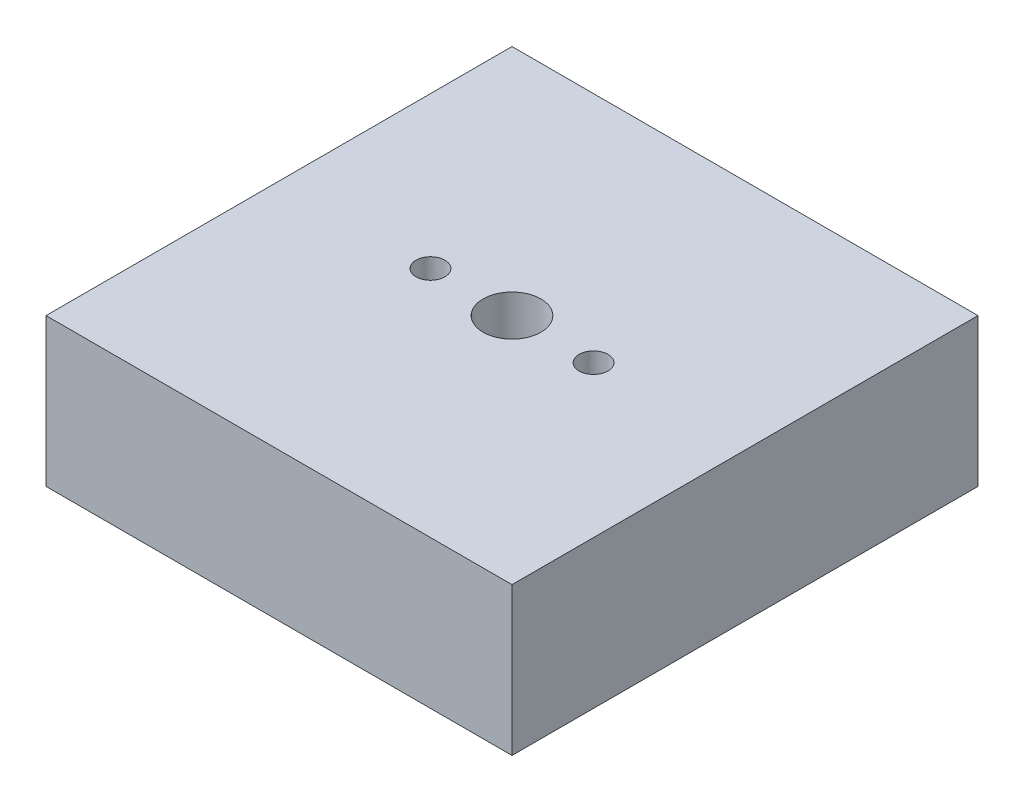
ISO-10303-21;
HEADER;
FILE_DESCRIPTION(('STEP AP214'),'2;1');
FILE_NAME('part.step','',(''),(''),'','','');
FILE_SCHEMA(('AUTOMOTIVE_DESIGN { 1 0 10303 214 1 1 1 1 }'));
ENDSEC;
DATA;
#1=APPLICATION_CONTEXT('core data for automotive mechanical design processes');
#2=APPLICATION_PROTOCOL_DEFINITION('international standard','automotive_design',2000,#1);
#3=PRODUCT_CONTEXT('',#1,'mechanical');
#4=PRODUCT('Part','Part','',(#3));
#5=PRODUCT_RELATED_PRODUCT_CATEGORY('part','',(#4));
#6=PRODUCT_DEFINITION_FORMATION('','',#4);
#7=PRODUCT_DEFINITION_CONTEXT('part definition',#1,'design');
#8=PRODUCT_DEFINITION('design','',#6,#7);
#9=PRODUCT_DEFINITION_SHAPE('','',#8);
#10=(LENGTH_UNIT() NAMED_UNIT(*) SI_UNIT(.MILLI.,.METRE.));
#11=(NAMED_UNIT(*) PLANE_ANGLE_UNIT() SI_UNIT($,.RADIAN.));
#12=(NAMED_UNIT(*) SI_UNIT($,.STERADIAN.) SOLID_ANGLE_UNIT());
#13=UNCERTAINTY_MEASURE_WITH_UNIT(LENGTH_MEASURE(1.E-05),#10,'distance_accuracy_value','');
#14=(GEOMETRIC_REPRESENTATION_CONTEXT(3) GLOBAL_UNCERTAINTY_ASSIGNED_CONTEXT((#13)) GLOBAL_UNIT_ASSIGNED_CONTEXT((#10,
#11,#12)) REPRESENTATION_CONTEXT('',''));
#15=CARTESIAN_POINT('',(0.,0.,0.));
#16=DIRECTION('',(0.,0.,1.));
#17=DIRECTION('',(1.,0.,0.));
#18=AXIS2_PLACEMENT_3D('',#15,#16,#17);
#19=CARTESIAN_POINT('',(0.,3.175,0.));
#20=DIRECTION('',(0.,-1.,0.));
#21=DIRECTION('',(0.,0.,-1.));
#22=AXIS2_PLACEMENT_3D('',#19,#20,#21);
#23=PLANE('',#22);
#24=CARTESIAN_POINT('',(0.,3.175,0.));
#25=DIRECTION('',(0.,1.,0.));
#26=DIRECTION('',(0.,0.,1.));
#27=AXIS2_PLACEMENT_3D('',#24,#25,#26);
#28=CIRCLE('',#27,0.62);
#29=CARTESIAN_POINT('',(0.,3.175,0.62));
#30=VERTEX_POINT('',#29);
#31=EDGE_CURVE('E115',#30,#30,#28,.T.);
#32=ORIENTED_EDGE('',*,*,#31,.F.);
#33=EDGE_LOOP('',(#32));
#34=FACE_BOUND('',#33,.T.);
#35=DIRECTION('',(0.,0.,1.));
#36=VECTOR('',#35,1.);
#37=CARTESIAN_POINT('',(-5.,3.175,5.));
#38=LINE('',#37,#36);
#39=CARTESIAN_POINT('',(-5.,3.175,-5.));
#40=VERTEX_POINT('',#39);
#41=CARTESIAN_POINT('',(-5.,3.175,5.));
#42=VERTEX_POINT('',#41);
#43=EDGE_CURVE('E85',#40,#42,#38,.T.);
#44=ORIENTED_EDGE('',*,*,#43,.T.);
#45=DIRECTION('',(1.,0.,0.));
#46=VECTOR('',#45,1.);
#47=CARTESIAN_POINT('',(-5.,3.175,5.));
#48=LINE('',#47,#46);
#49=CARTESIAN_POINT('',(5.,3.175,5.));
#50=VERTEX_POINT('',#49);
#51=EDGE_CURVE('E80',#42,#50,#48,.T.);
#52=ORIENTED_EDGE('',*,*,#51,.T.);
#53=DIRECTION('',(0.,0.,-1.));
#54=VECTOR('',#53,1.);
#55=CARTESIAN_POINT('',(5.,3.175,5.));
#56=LINE('',#55,#54);
#57=CARTESIAN_POINT('',(5.,3.175,-5.));
#58=VERTEX_POINT('',#57);
#59=EDGE_CURVE('E83',#50,#58,#56,.T.);
#60=ORIENTED_EDGE('',*,*,#59,.T.);
#61=DIRECTION('',(-1.,0.,0.));
#62=VECTOR('',#61,1.);
#63=CARTESIAN_POINT('',(-5.,3.175,-5.));
#64=LINE('',#63,#62);
#65=EDGE_CURVE('E50',#58,#40,#64,.T.);
#66=ORIENTED_EDGE('',*,*,#65,.T.);
#67=EDGE_LOOP('',(#44,#52,#60,#66));
#68=FACE_BOUND('',#67,.T.);
#69=CARTESIAN_POINT('',(-1.75,3.175,0.));
#70=DIRECTION('',(0.,1.,0.));
#71=DIRECTION('',(0.,0.,1.));
#72=AXIS2_PLACEMENT_3D('',#69,#70,#71);
#73=CIRCLE('',#72,0.31);
#74=CARTESIAN_POINT('',(-1.75,3.175,0.31));
#75=VERTEX_POINT('',#74);
#76=EDGE_CURVE('E100',#75,#75,#73,.T.);
#77=ORIENTED_EDGE('',*,*,#76,.F.);
#78=EDGE_LOOP('',(#77));
#79=FACE_BOUND('',#78,.T.);
#80=CARTESIAN_POINT('',(1.75,3.175,0.));
#81=DIRECTION('',(0.,1.,0.));
#82=DIRECTION('',(0.,0.,1.));
#83=AXIS2_PLACEMENT_3D('',#80,#81,#82);
#84=CIRCLE('',#83,0.31);
#85=CARTESIAN_POINT('',(1.75,3.175,0.31));
#86=VERTEX_POINT('',#85);
#87=EDGE_CURVE('E121',#86,#86,#84,.T.);
#88=ORIENTED_EDGE('',*,*,#87,.F.);
#89=EDGE_LOOP('',(#88));
#90=FACE_BOUND('',#89,.T.);
#91=ADVANCED_FACE('F33',(#34,#68,#79,#90),#23,.F.);
#92=CARTESIAN_POINT('',(0.,0.,0.));
#93=DIRECTION('',(0.,-1.,0.));
#94=DIRECTION('',(0.,0.,-1.));
#95=AXIS2_PLACEMENT_3D('',#92,#93,#94);
#96=PLANE('',#95);
#97=CARTESIAN_POINT('',(0.,0.,0.));
#98=DIRECTION('',(0.,1.,0.));
#99=DIRECTION('',(0.,0.,1.));
#100=AXIS2_PLACEMENT_3D('',#97,#98,#99);
#101=CIRCLE('',#100,0.62);
#102=CARTESIAN_POINT('',(0.,0.,0.62));
#103=VERTEX_POINT('',#102);
#104=EDGE_CURVE('E118',#103,#103,#101,.T.);
#105=ORIENTED_EDGE('',*,*,#104,.T.);
#106=EDGE_LOOP('',(#105));
#107=FACE_BOUND('',#106,.T.);
#108=DIRECTION('',(0.,0.,1.));
#109=VECTOR('',#108,1.);
#110=CARTESIAN_POINT('',(-5.,0.,5.));
#111=LINE('',#110,#109);
#112=CARTESIAN_POINT('',(-5.,0.,-5.));
#113=VERTEX_POINT('',#112);
#114=CARTESIAN_POINT('',(-5.,0.,5.));
#115=VERTEX_POINT('',#114);
#116=EDGE_CURVE('E97',#113,#115,#111,.T.);
#117=ORIENTED_EDGE('',*,*,#116,.F.);
#118=DIRECTION('',(-1.,0.,0.));
#119=VECTOR('',#118,1.);
#120=CARTESIAN_POINT('',(-5.,0.,-5.));
#121=LINE('',#120,#119);
#122=CARTESIAN_POINT('',(5.,0.,-5.));
#123=VERTEX_POINT('',#122);
#124=EDGE_CURVE('E73',#123,#113,#121,.T.);
#125=ORIENTED_EDGE('',*,*,#124,.F.);
#126=DIRECTION('',(0.,0.,-1.));
#127=VECTOR('',#126,1.);
#128=CARTESIAN_POINT('',(5.,0.,5.));
#129=LINE('',#128,#127);
#130=CARTESIAN_POINT('',(5.,0.,5.));
#131=VERTEX_POINT('',#130);
#132=EDGE_CURVE('E67',#131,#123,#129,.T.);
#133=ORIENTED_EDGE('',*,*,#132,.F.);
#134=DIRECTION('',(1.,0.,0.));
#135=VECTOR('',#134,1.);
#136=CARTESIAN_POINT('',(-5.,0.,5.));
#137=LINE('',#136,#135);
#138=EDGE_CURVE('E89',#115,#131,#137,.T.);
#139=ORIENTED_EDGE('',*,*,#138,.F.);
#140=EDGE_LOOP('',(#117,#125,#133,#139));
#141=FACE_BOUND('',#140,.T.);
#142=CARTESIAN_POINT('',(-1.75,0.,0.));
#143=DIRECTION('',(0.,1.,0.));
#144=DIRECTION('',(0.,0.,1.));
#145=AXIS2_PLACEMENT_3D('',#142,#143,#144);
#146=CIRCLE('',#145,0.31);
#147=CARTESIAN_POINT('',(-1.75,0.,0.31));
#148=VERTEX_POINT('',#147);
#149=EDGE_CURVE('E112',#148,#148,#146,.T.);
#150=ORIENTED_EDGE('',*,*,#149,.T.);
#151=EDGE_LOOP('',(#150));
#152=FACE_BOUND('',#151,.T.);
#153=CARTESIAN_POINT('',(1.75,0.,0.));
#154=DIRECTION('',(0.,1.,0.));
#155=DIRECTION('',(0.,0.,1.));
#156=AXIS2_PLACEMENT_3D('',#153,#154,#155);
#157=CIRCLE('',#156,0.31);
#158=CARTESIAN_POINT('',(1.75,0.,0.31));
#159=VERTEX_POINT('',#158);
#160=EDGE_CURVE('E124',#159,#159,#157,.T.);
#161=ORIENTED_EDGE('',*,*,#160,.T.);
#162=EDGE_LOOP('',(#161));
#163=FACE_BOUND('',#162,.T.);
#164=ADVANCED_FACE('F108',(#107,#141,#152,#163),#96,.T.);
#165=CARTESIAN_POINT('',(-5.,3.175,5.));
#166=DIRECTION('',(1.,0.,0.));
#167=DIRECTION('',(0.,0.,-1.));
#168=AXIS2_PLACEMENT_3D('',#165,#166,#167);
#169=PLANE('',#168);
#170=ORIENTED_EDGE('',*,*,#116,.T.);
#171=DIRECTION('',(0.,-1.,0.));
#172=VECTOR('',#171,1.);
#173=CARTESIAN_POINT('',(-5.,3.175,5.));
#174=LINE('',#173,#172);
#175=EDGE_CURVE('E11',#42,#115,#174,.T.);
#176=ORIENTED_EDGE('',*,*,#175,.F.);
#177=ORIENTED_EDGE('',*,*,#43,.F.);
#178=DIRECTION('',(0.,-1.,0.));
#179=VECTOR('',#178,1.);
#180=CARTESIAN_POINT('',(-5.,3.175,-5.));
#181=LINE('',#180,#179);
#182=EDGE_CURVE('E93',#40,#113,#181,.T.);
#183=ORIENTED_EDGE('',*,*,#182,.T.);
#184=EDGE_LOOP('',(#170,#176,#177,#183));
#185=FACE_BOUND('',#184,.T.);
#186=ADVANCED_FACE('F35',(#185),#169,.F.);
#187=CARTESIAN_POINT('',(-5.,3.175,5.));
#188=DIRECTION('',(0.,0.,-1.));
#189=DIRECTION('',(-1.,0.,0.));
#190=AXIS2_PLACEMENT_3D('',#187,#188,#189);
#191=PLANE('',#190);
#192=ORIENTED_EDGE('',*,*,#138,.T.);
#193=DIRECTION('',(0.,-1.,0.));
#194=VECTOR('',#193,1.);
#195=CARTESIAN_POINT('',(5.,3.175,5.));
#196=LINE('',#195,#194);
#197=EDGE_CURVE('E42',#50,#131,#196,.T.);
#198=ORIENTED_EDGE('',*,*,#197,.F.);
#199=ORIENTED_EDGE('',*,*,#51,.F.);
#200=ORIENTED_EDGE('',*,*,#175,.T.);
#201=EDGE_LOOP('',(#192,#198,#199,#200));
#202=FACE_BOUND('',#201,.T.);
#203=ADVANCED_FACE('F88',(#202),#191,.F.);
#204=CARTESIAN_POINT('',(5.,3.175,5.));
#205=DIRECTION('',(-1.,0.,0.));
#206=DIRECTION('',(0.,0.,1.));
#207=AXIS2_PLACEMENT_3D('',#204,#205,#206);
#208=PLANE('',#207);
#209=ORIENTED_EDGE('',*,*,#132,.T.);
#210=DIRECTION('',(0.,-1.,0.));
#211=VECTOR('',#210,1.);
#212=CARTESIAN_POINT('',(5.,3.175,-5.));
#213=LINE('',#212,#211);
#214=EDGE_CURVE('E90',#58,#123,#213,.T.);
#215=ORIENTED_EDGE('',*,*,#214,.F.);
#216=ORIENTED_EDGE('',*,*,#59,.F.);
#217=ORIENTED_EDGE('',*,*,#197,.T.);
#218=EDGE_LOOP('',(#209,#215,#216,#217));
#219=FACE_BOUND('',#218,.T.);
#220=ADVANCED_FACE('F91',(#219),#208,.F.);
#221=CARTESIAN_POINT('',(-5.,3.175,-5.));
#222=DIRECTION('',(0.,0.,1.));
#223=DIRECTION('',(1.,0.,0.));
#224=AXIS2_PLACEMENT_3D('',#221,#222,#223);
#225=PLANE('',#224);
#226=ORIENTED_EDGE('',*,*,#124,.T.);
#227=ORIENTED_EDGE('',*,*,#182,.F.);
#228=ORIENTED_EDGE('',*,*,#65,.F.);
#229=ORIENTED_EDGE('',*,*,#214,.T.);
#230=EDGE_LOOP('',(#226,#227,#228,#229));
#231=FACE_BOUND('',#230,.T.);
#232=ADVANCED_FACE('F105',(#231),#225,.F.);
#233=CARTESIAN_POINT('',(-1.75,3.175,0.));
#234=DIRECTION('',(0.,-1.,0.));
#235=DIRECTION('',(0.,0.,-1.));
#236=AXIS2_PLACEMENT_3D('',#233,#234,#235);
#237=CYLINDRICAL_SURFACE('',#236,0.31);
#238=ORIENTED_EDGE('',*,*,#76,.T.);
#239=EDGE_LOOP('',(#238));
#240=FACE_BOUND('',#239,.T.);
#241=ORIENTED_EDGE('',*,*,#149,.F.);
#242=EDGE_LOOP('',(#241));
#243=FACE_BOUND('',#242,.T.);
#244=ADVANCED_FACE('F143',(#240,#243),#237,.F.);
#245=CARTESIAN_POINT('',(0.,3.175,0.));
#246=DIRECTION('',(0.,-1.,0.));
#247=DIRECTION('',(0.,0.,-1.));
#248=AXIS2_PLACEMENT_3D('',#245,#246,#247);
#249=CYLINDRICAL_SURFACE('',#248,0.62);
#250=ORIENTED_EDGE('',*,*,#31,.T.);
#251=EDGE_LOOP('',(#250));
#252=FACE_BOUND('',#251,.T.);
#253=ORIENTED_EDGE('',*,*,#104,.F.);
#254=EDGE_LOOP('',(#253));
#255=FACE_BOUND('',#254,.T.);
#256=ADVANCED_FACE('F189',(#252,#255),#249,.F.);
#257=CARTESIAN_POINT('',(1.75,3.175,0.));
#258=DIRECTION('',(0.,-1.,0.));
#259=DIRECTION('',(0.,0.,-1.));
#260=AXIS2_PLACEMENT_3D('',#257,#258,#259);
#261=CYLINDRICAL_SURFACE('',#260,0.31);
#262=ORIENTED_EDGE('',*,*,#87,.T.);
#263=EDGE_LOOP('',(#262));
#264=FACE_BOUND('',#263,.T.);
#265=ORIENTED_EDGE('',*,*,#160,.F.);
#266=EDGE_LOOP('',(#265));
#267=FACE_BOUND('',#266,.T.);
#268=ADVANCED_FACE('F130',(#264,#267),#261,.F.);
#269=CLOSED_SHELL('',(#91,#164,#186,#203,#220,#232,#244,#256,#268));
#270=MANIFOLD_SOLID_BREP('B2',#269);
#271=ADVANCED_BREP_SHAPE_REPRESENTATION('',(#18,#270),#14);
#272=SHAPE_DEFINITION_REPRESENTATION(#9,#271);
ENDSEC;
END-ISO-10303-21;
